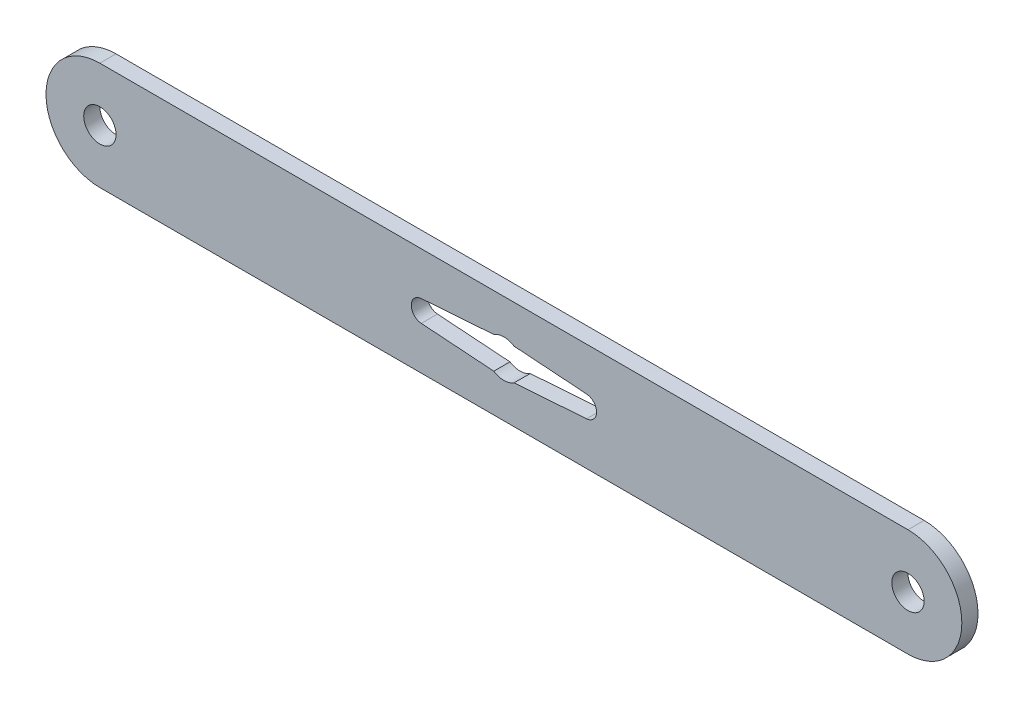
ISO-10303-21;
HEADER;
FILE_DESCRIPTION(('STEP AP214'),'2;1');
FILE_NAME('part.step','',(''),(''),'','','');
FILE_SCHEMA(('AUTOMOTIVE_DESIGN { 1 0 10303 214 1 1 1 1 }'));
ENDSEC;
DATA;
#1=APPLICATION_CONTEXT('core data for automotive mechanical design processes');
#2=APPLICATION_PROTOCOL_DEFINITION('international standard','automotive_design',2000,#1);
#3=PRODUCT_CONTEXT('',#1,'mechanical');
#4=PRODUCT('Part','Part','',(#3));
#5=PRODUCT_RELATED_PRODUCT_CATEGORY('part','',(#4));
#6=PRODUCT_DEFINITION_FORMATION('','',#4);
#7=PRODUCT_DEFINITION_CONTEXT('part definition',#1,'design');
#8=PRODUCT_DEFINITION('design','',#6,#7);
#9=PRODUCT_DEFINITION_SHAPE('','',#8);
#10=(LENGTH_UNIT() NAMED_UNIT(*) SI_UNIT(.MILLI.,.METRE.));
#11=(NAMED_UNIT(*) PLANE_ANGLE_UNIT() SI_UNIT($,.RADIAN.));
#12=(NAMED_UNIT(*) SI_UNIT($,.STERADIAN.) SOLID_ANGLE_UNIT());
#13=UNCERTAINTY_MEASURE_WITH_UNIT(LENGTH_MEASURE(1.E-05),#10,'distance_accuracy_value','');
#14=(GEOMETRIC_REPRESENTATION_CONTEXT(3) GLOBAL_UNCERTAINTY_ASSIGNED_CONTEXT((#13)) GLOBAL_UNIT_ASSIGNED_CONTEXT((#10,
#11,#12)) REPRESENTATION_CONTEXT('',''));
#15=CARTESIAN_POINT('',(0.,0.,0.));
#16=DIRECTION('',(0.,0.,1.));
#17=DIRECTION('',(1.,0.,0.));
#18=AXIS2_PLACEMENT_3D('',#15,#16,#17);
#19=CARTESIAN_POINT('',(75.,0.,3.));
#20=DIRECTION('',(0.,0.,1.));
#21=DIRECTION('',(1.,0.,0.));
#22=AXIS2_PLACEMENT_3D('',#19,#20,#21);
#23=PLANE('',#22);
#24=DIRECTION('',(-0.997491646220285,-0.0707842900702252,0.));
#25=VECTOR('',#24,1.);
#26=CARTESIAN_POINT('',(-1.88348082018375,2.94999999999999,3.));
#27=LINE('',#26,#25);
#28=CARTESIAN_POINT('',(-1.88348082018375,2.94999999999999,3.));
#29=VERTEX_POINT('',#28);
#30=CARTESIAN_POINT('',(-15.3415685801405,1.99498329244057,3.));
#31=VERTEX_POINT('',#30);
#32=EDGE_CURVE('E134',#29,#31,#27,.T.);
#33=ORIENTED_EDGE('',*,*,#32,.F.);
#34=CARTESIAN_POINT('',(0.,0.,3.));
#35=DIRECTION('',(0.,0.,1.));
#36=DIRECTION('',(1.,0.,0.));
#37=AXIS2_PLACEMENT_3D('',#34,#35,#36);
#38=CIRCLE('',#37,3.5);
#39=CARTESIAN_POINT('',(1.88348082018375,2.94999999999999,3.));
#40=VERTEX_POINT('',#39);
#41=EDGE_CURVE('E126',#40,#29,#38,.T.);
#42=ORIENTED_EDGE('',*,*,#41,.F.);
#43=DIRECTION('',(-0.997491646220285,0.070784290070225,0.));
#44=VECTOR('',#43,1.);
#45=CARTESIAN_POINT('',(1.88348082018375,2.94999999999999,3.));
#46=LINE('',#45,#44);
#47=CARTESIAN_POINT('',(15.3415685801404,1.99498329244057,3.));
#48=VERTEX_POINT('',#47);
#49=EDGE_CURVE('E161',#48,#40,#46,.T.);
#50=ORIENTED_EDGE('',*,*,#49,.F.);
#51=CARTESIAN_POINT('',(15.2,0.,3.));
#52=DIRECTION('',(0.,0.,1.));
#53=DIRECTION('',(-1.,0.,0.));
#54=AXIS2_PLACEMENT_3D('',#51,#52,#53);
#55=CIRCLE('',#54,2.);
#56=CARTESIAN_POINT('',(15.3415685801405,-1.99498329244057,3.));
#57=VERTEX_POINT('',#56);
#58=EDGE_CURVE('E159',#57,#48,#55,.T.);
#59=ORIENTED_EDGE('',*,*,#58,.F.);
#60=DIRECTION('',(0.997491646220285,0.0707842900702261,0.));
#61=VECTOR('',#60,1.);
#62=CARTESIAN_POINT('',(1.88348082018375,-2.95000000000001,3.));
#63=LINE('',#62,#61);
#64=CARTESIAN_POINT('',(1.88348082018375,-2.95000000000001,3.));
#65=VERTEX_POINT('',#64);
#66=EDGE_CURVE('E157',#65,#57,#63,.T.);
#67=ORIENTED_EDGE('',*,*,#66,.F.);
#68=CARTESIAN_POINT('',(0.,0.,3.));
#69=DIRECTION('',(0.,0.,1.));
#70=DIRECTION('',(1.,0.,0.));
#71=AXIS2_PLACEMENT_3D('',#68,#69,#70);
#72=CIRCLE('',#71,3.50000000000001);
#73=CARTESIAN_POINT('',(-1.88348082018375,-2.95000000000001,3.));
#74=VERTEX_POINT('',#73);
#75=EDGE_CURVE('E155',#74,#65,#72,.T.);
#76=ORIENTED_EDGE('',*,*,#75,.F.);
#77=DIRECTION('',(0.997491646220285,-0.0707842900702266,0.));
#78=VECTOR('',#77,1.);
#79=CARTESIAN_POINT('',(-1.88348082018375,-2.95000000000001,3.));
#80=LINE('',#79,#78);
#81=CARTESIAN_POINT('',(-15.3415685801405,-1.99498329244057,3.));
#82=VERTEX_POINT('',#81);
#83=EDGE_CURVE('E150',#82,#74,#80,.T.);
#84=ORIENTED_EDGE('',*,*,#83,.F.);
#85=CARTESIAN_POINT('',(-15.2,0.,3.));
#86=DIRECTION('',(0.,0.,1.));
#87=DIRECTION('',(1.,0.,0.));
#88=AXIS2_PLACEMENT_3D('',#85,#86,#87);
#89=CIRCLE('',#88,2.);
#90=EDGE_CURVE('E148',#31,#82,#89,.T.);
#91=ORIENTED_EDGE('',*,*,#90,.F.);
#92=EDGE_LOOP('',(#33,#42,#50,#59,#67,#76,#84,#91));
#93=FACE_BOUND('',#92,.T.);
#94=CARTESIAN_POINT('',(75.,0.,3.));
#95=DIRECTION('',(0.,0.,1.));
#96=DIRECTION('',(1.,0.,0.));
#97=AXIS2_PLACEMENT_3D('',#94,#95,#96);
#98=CIRCLE('',#97,3.00000000000001);
#99=CARTESIAN_POINT('',(78.,0.,3.));
#100=VERTEX_POINT('',#99);
#101=EDGE_CURVE('E194',#100,#100,#98,.T.);
#102=ORIENTED_EDGE('',*,*,#101,.F.);
#103=EDGE_LOOP('',(#102));
#104=FACE_BOUND('',#103,.T.);
#105=CARTESIAN_POINT('',(75.,0.,3.));
#106=DIRECTION('',(0.,0.,1.));
#107=DIRECTION('',(1.,0.,0.));
#108=AXIS2_PLACEMENT_3D('',#105,#106,#107);
#109=CIRCLE('',#108,10.);
#110=CARTESIAN_POINT('',(75.,-10.,3.));
#111=VERTEX_POINT('',#110);
#112=CARTESIAN_POINT('',(75.,9.99999999999998,3.));
#113=VERTEX_POINT('',#112);
#114=EDGE_CURVE('E200',#111,#113,#109,.T.);
#115=ORIENTED_EDGE('',*,*,#114,.T.);
#116=DIRECTION('',(-1.,0.,0.));
#117=VECTOR('',#116,1.);
#118=CARTESIAN_POINT('',(75.,9.99999999999998,3.));
#119=LINE('',#118,#117);
#120=CARTESIAN_POINT('',(-75.,10.,3.));
#121=VERTEX_POINT('',#120);
#122=EDGE_CURVE('E203',#113,#121,#119,.T.);
#123=ORIENTED_EDGE('',*,*,#122,.T.);
#124=CARTESIAN_POINT('',(-75.,0.,3.));
#125=DIRECTION('',(0.,0.,1.));
#126=DIRECTION('',(1.,0.,0.));
#127=AXIS2_PLACEMENT_3D('',#124,#125,#126);
#128=CIRCLE('',#127,10.);
#129=CARTESIAN_POINT('',(-75.,-10.,3.));
#130=VERTEX_POINT('',#129);
#131=EDGE_CURVE('E206',#121,#130,#128,.T.);
#132=ORIENTED_EDGE('',*,*,#131,.T.);
#133=DIRECTION('',(1.,0.,0.));
#134=VECTOR('',#133,1.);
#135=CARTESIAN_POINT('',(75.,-10.,3.));
#136=LINE('',#135,#134);
#137=EDGE_CURVE('E208',#130,#111,#136,.T.);
#138=ORIENTED_EDGE('',*,*,#137,.T.);
#139=EDGE_LOOP('',(#115,#123,#132,#138));
#140=FACE_BOUND('',#139,.T.);
#141=CARTESIAN_POINT('',(-75.,0.,3.));
#142=DIRECTION('',(0.,0.,1.));
#143=DIRECTION('',(-1.,0.,0.));
#144=AXIS2_PLACEMENT_3D('',#141,#142,#143);
#145=CIRCLE('',#144,3.00000000000001);
#146=CARTESIAN_POINT('',(-78.,0.,3.));
#147=VERTEX_POINT('',#146);
#148=EDGE_CURVE('E164',#147,#147,#145,.T.);
#149=ORIENTED_EDGE('',*,*,#148,.F.);
#150=EDGE_LOOP('',(#149));
#151=FACE_BOUND('',#150,.T.);
#152=ADVANCED_FACE('F37',(#93,#104,#140,#151),#23,.T.);
#153=CARTESIAN_POINT('',(75.,0.,0.));
#154=DIRECTION('',(0.,0.,1.));
#155=DIRECTION('',(1.,0.,0.));
#156=AXIS2_PLACEMENT_3D('',#153,#154,#155);
#157=PLANE('',#156);
#158=CARTESIAN_POINT('',(75.,0.,0.));
#159=DIRECTION('',(0.,0.,1.));
#160=DIRECTION('',(1.,0.,0.));
#161=AXIS2_PLACEMENT_3D('',#158,#159,#160);
#162=CIRCLE('',#161,3.00000000000001);
#163=CARTESIAN_POINT('',(78.,0.,0.));
#164=VERTEX_POINT('',#163);
#165=EDGE_CURVE('E142',#164,#164,#162,.T.);
#166=ORIENTED_EDGE('',*,*,#165,.T.);
#167=EDGE_LOOP('',(#166));
#168=FACE_BOUND('',#167,.T.);
#169=CARTESIAN_POINT('',(75.,0.,0.));
#170=DIRECTION('',(0.,0.,1.));
#171=DIRECTION('',(1.,0.,0.));
#172=AXIS2_PLACEMENT_3D('',#169,#170,#171);
#173=CIRCLE('',#172,10.);
#174=CARTESIAN_POINT('',(75.,-10.,0.));
#175=VERTEX_POINT('',#174);
#176=CARTESIAN_POINT('',(75.,9.99999999999998,0.));
#177=VERTEX_POINT('',#176);
#178=EDGE_CURVE('E197',#175,#177,#173,.T.);
#179=ORIENTED_EDGE('',*,*,#178,.F.);
#180=DIRECTION('',(1.,0.,0.));
#181=VECTOR('',#180,1.);
#182=CARTESIAN_POINT('',(75.,-10.,0.));
#183=LINE('',#182,#181);
#184=CARTESIAN_POINT('',(-75.,-10.,0.));
#185=VERTEX_POINT('',#184);
#186=EDGE_CURVE('E204',#185,#175,#183,.T.);
#187=ORIENTED_EDGE('',*,*,#186,.F.);
#188=CARTESIAN_POINT('',(-75.,0.,0.));
#189=DIRECTION('',(0.,0.,1.));
#190=DIRECTION('',(1.,0.,0.));
#191=AXIS2_PLACEMENT_3D('',#188,#189,#190);
#192=CIRCLE('',#191,10.);
#193=CARTESIAN_POINT('',(-75.,10.,0.));
#194=VERTEX_POINT('',#193);
#195=EDGE_CURVE('E215',#194,#185,#192,.T.);
#196=ORIENTED_EDGE('',*,*,#195,.F.);
#197=DIRECTION('',(-1.,0.,0.));
#198=VECTOR('',#197,1.);
#199=CARTESIAN_POINT('',(75.,9.99999999999998,0.));
#200=LINE('',#199,#198);
#201=EDGE_CURVE('E213',#177,#194,#200,.T.);
#202=ORIENTED_EDGE('',*,*,#201,.F.);
#203=EDGE_LOOP('',(#179,#187,#196,#202));
#204=FACE_BOUND('',#203,.T.);
#205=CARTESIAN_POINT('',(0.,0.,0.));
#206=DIRECTION('',(0.,0.,1.));
#207=DIRECTION('',(1.,0.,0.));
#208=AXIS2_PLACEMENT_3D('',#205,#206,#207);
#209=CIRCLE('',#208,3.5);
#210=CARTESIAN_POINT('',(1.88348082018375,2.94999999999999,0.));
#211=VERTEX_POINT('',#210);
#212=CARTESIAN_POINT('',(-1.88348082018375,2.94999999999999,0.));
#213=VERTEX_POINT('',#212);
#214=EDGE_CURVE('E60',#211,#213,#209,.T.);
#215=ORIENTED_EDGE('',*,*,#214,.T.);
#216=DIRECTION('',(-0.997491646220285,-0.0707842900702252,0.));
#217=VECTOR('',#216,1.);
#218=CARTESIAN_POINT('',(-1.88348082018375,2.94999999999999,0.));
#219=LINE('',#218,#217);
#220=CARTESIAN_POINT('',(-15.3415685801405,1.99498329244057,0.));
#221=VERTEX_POINT('',#220);
#222=EDGE_CURVE('E141',#213,#221,#219,.T.);
#223=ORIENTED_EDGE('',*,*,#222,.T.);
#224=CARTESIAN_POINT('',(-15.2,0.,0.));
#225=DIRECTION('',(0.,0.,1.));
#226=DIRECTION('',(1.,0.,0.));
#227=AXIS2_PLACEMENT_3D('',#224,#225,#226);
#228=CIRCLE('',#227,2.);
#229=CARTESIAN_POINT('',(-15.3415685801405,-1.99498329244057,0.));
#230=VERTEX_POINT('',#229);
#231=EDGE_CURVE('E166',#221,#230,#228,.T.);
#232=ORIENTED_EDGE('',*,*,#231,.T.);
#233=DIRECTION('',(0.997491646220285,-0.0707842900702266,0.));
#234=VECTOR('',#233,1.);
#235=CARTESIAN_POINT('',(-1.88348082018375,-2.95000000000001,0.));
#236=LINE('',#235,#234);
#237=CARTESIAN_POINT('',(-1.88348082018375,-2.95000000000001,0.));
#238=VERTEX_POINT('',#237);
#239=EDGE_CURVE('E169',#230,#238,#236,.T.);
#240=ORIENTED_EDGE('',*,*,#239,.T.);
#241=CARTESIAN_POINT('',(0.,0.,0.));
#242=DIRECTION('',(0.,0.,1.));
#243=DIRECTION('',(1.,0.,0.));
#244=AXIS2_PLACEMENT_3D('',#241,#242,#243);
#245=CIRCLE('',#244,3.50000000000001);
#246=CARTESIAN_POINT('',(1.88348082018375,-2.95000000000001,0.));
#247=VERTEX_POINT('',#246);
#248=EDGE_CURVE('E172',#238,#247,#245,.T.);
#249=ORIENTED_EDGE('',*,*,#248,.T.);
#250=DIRECTION('',(0.997491646220285,0.0707842900702261,0.));
#251=VECTOR('',#250,1.);
#252=CARTESIAN_POINT('',(1.88348082018375,-2.95000000000001,0.));
#253=LINE('',#252,#251);
#254=CARTESIAN_POINT('',(15.3415685801405,-1.99498329244057,0.));
#255=VERTEX_POINT('',#254);
#256=EDGE_CURVE('E175',#247,#255,#253,.T.);
#257=ORIENTED_EDGE('',*,*,#256,.T.);
#258=CARTESIAN_POINT('',(15.2,0.,0.));
#259=DIRECTION('',(0.,0.,1.));
#260=DIRECTION('',(-1.,0.,0.));
#261=AXIS2_PLACEMENT_3D('',#258,#259,#260);
#262=CIRCLE('',#261,2.);
#263=CARTESIAN_POINT('',(15.3415685801405,1.99498329244058,0.));
#264=VERTEX_POINT('',#263);
#265=EDGE_CURVE('E178',#255,#264,#262,.T.);
#266=ORIENTED_EDGE('',*,*,#265,.T.);
#267=DIRECTION('',(-0.997491646220285,0.070784290070225,0.));
#268=VECTOR('',#267,1.);
#269=CARTESIAN_POINT('',(1.88348082018375,2.94999999999999,0.));
#270=LINE('',#269,#268);
#271=EDGE_CURVE('E135',#264,#211,#270,.T.);
#272=ORIENTED_EDGE('',*,*,#271,.T.);
#273=EDGE_LOOP('',(#215,#223,#232,#240,#249,#257,#266,#272));
#274=FACE_BOUND('',#273,.T.);
#275=CARTESIAN_POINT('',(-75.,0.,0.));
#276=DIRECTION('',(0.,0.,1.));
#277=DIRECTION('',(-1.,0.,0.));
#278=AXIS2_PLACEMENT_3D('',#275,#276,#277);
#279=CIRCLE('',#278,3.00000000000001);
#280=CARTESIAN_POINT('',(-78.,0.,0.));
#281=VERTEX_POINT('',#280);
#282=EDGE_CURVE('E311',#281,#281,#279,.T.);
#283=ORIENTED_EDGE('',*,*,#282,.T.);
#284=EDGE_LOOP('',(#283));
#285=FACE_BOUND('',#284,.T.);
#286=ADVANCED_FACE('F233',(#168,#204,#274,#285),#157,.F.);
#287=CARTESIAN_POINT('',(75.,0.,3.));
#288=DIRECTION('',(0.,0.,-1.));
#289=DIRECTION('',(-1.,0.,0.));
#290=AXIS2_PLACEMENT_3D('',#287,#288,#289);
#291=CYLINDRICAL_SURFACE('',#290,10.);
#292=ORIENTED_EDGE('',*,*,#178,.T.);
#293=DIRECTION('',(0.,0.,-1.));
#294=VECTOR('',#293,1.);
#295=CARTESIAN_POINT('',(75.,9.99999999999998,3.));
#296=LINE('',#295,#294);
#297=EDGE_CURVE('E11',#113,#177,#296,.T.);
#298=ORIENTED_EDGE('',*,*,#297,.F.);
#299=ORIENTED_EDGE('',*,*,#114,.F.);
#300=DIRECTION('',(0.,0.,-1.));
#301=VECTOR('',#300,1.);
#302=CARTESIAN_POINT('',(75.,-10.,3.));
#303=LINE('',#302,#301);
#304=EDGE_CURVE('E210',#111,#175,#303,.T.);
#305=ORIENTED_EDGE('',*,*,#304,.T.);
#306=EDGE_LOOP('',(#292,#298,#299,#305));
#307=FACE_BOUND('',#306,.T.);
#308=ADVANCED_FACE('F39',(#307),#291,.T.);
#309=CARTESIAN_POINT('',(75.,9.99999999999998,3.));
#310=DIRECTION('',(0.,-1.,0.));
#311=DIRECTION('',(1.,0.,0.));
#312=AXIS2_PLACEMENT_3D('',#309,#310,#311);
#313=PLANE('',#312);
#314=ORIENTED_EDGE('',*,*,#201,.T.);
#315=DIRECTION('',(0.,0.,-1.));
#316=VECTOR('',#315,1.);
#317=CARTESIAN_POINT('',(-75.,10.,3.));
#318=LINE('',#317,#316);
#319=EDGE_CURVE('E45',#121,#194,#318,.T.);
#320=ORIENTED_EDGE('',*,*,#319,.F.);
#321=ORIENTED_EDGE('',*,*,#122,.F.);
#322=ORIENTED_EDGE('',*,*,#297,.T.);
#323=EDGE_LOOP('',(#314,#320,#321,#322));
#324=FACE_BOUND('',#323,.T.);
#325=ADVANCED_FACE('F244',(#324),#313,.F.);
#326=CARTESIAN_POINT('',(-75.,0.,3.));
#327=DIRECTION('',(0.,0.,-1.));
#328=DIRECTION('',(-1.,0.,0.));
#329=AXIS2_PLACEMENT_3D('',#326,#327,#328);
#330=CYLINDRICAL_SURFACE('',#329,10.);
#331=ORIENTED_EDGE('',*,*,#195,.T.);
#332=DIRECTION('',(0.,0.,-1.));
#333=VECTOR('',#332,1.);
#334=CARTESIAN_POINT('',(-75.,-10.,3.));
#335=LINE('',#334,#333);
#336=EDGE_CURVE('E220',#130,#185,#335,.T.);
#337=ORIENTED_EDGE('',*,*,#336,.F.);
#338=ORIENTED_EDGE('',*,*,#131,.F.);
#339=ORIENTED_EDGE('',*,*,#319,.T.);
#340=EDGE_LOOP('',(#331,#337,#338,#339));
#341=FACE_BOUND('',#340,.T.);
#342=ADVANCED_FACE('F227',(#341),#330,.T.);
#343=CARTESIAN_POINT('',(75.,-10.,3.));
#344=DIRECTION('',(0.,1.,0.));
#345=DIRECTION('',(-1.,0.,0.));
#346=AXIS2_PLACEMENT_3D('',#343,#344,#345);
#347=PLANE('',#346);
#348=ORIENTED_EDGE('',*,*,#186,.T.);
#349=ORIENTED_EDGE('',*,*,#304,.F.);
#350=ORIENTED_EDGE('',*,*,#137,.F.);
#351=ORIENTED_EDGE('',*,*,#336,.T.);
#352=EDGE_LOOP('',(#348,#349,#350,#351));
#353=FACE_BOUND('',#352,.T.);
#354=ADVANCED_FACE('F237',(#353),#347,.F.);
#355=CARTESIAN_POINT('',(75.,0.,3.));
#356=DIRECTION('',(0.,0.,-1.));
#357=DIRECTION('',(-1.,0.,0.));
#358=AXIS2_PLACEMENT_3D('',#355,#356,#357);
#359=CYLINDRICAL_SURFACE('',#358,3.00000000000001);
#360=ORIENTED_EDGE('',*,*,#101,.T.);
#361=EDGE_LOOP('',(#360));
#362=FACE_BOUND('',#361,.T.);
#363=ORIENTED_EDGE('',*,*,#165,.F.);
#364=EDGE_LOOP('',(#363));
#365=FACE_BOUND('',#364,.T.);
#366=ADVANCED_FACE('F259',(#362,#365),#359,.F.);
#367=CARTESIAN_POINT('',(0.,0.,3.));
#368=DIRECTION('',(0.,0.,-1.));
#369=DIRECTION('',(-1.,0.,0.));
#370=AXIS2_PLACEMENT_3D('',#367,#368,#369);
#371=CYLINDRICAL_SURFACE('',#370,3.5);
#372=ORIENTED_EDGE('',*,*,#214,.F.);
#373=DIRECTION('',(0.,0.,-1.));
#374=VECTOR('',#373,1.);
#375=CARTESIAN_POINT('',(1.88348082018375,2.94999999999999,3.));
#376=LINE('',#375,#374);
#377=EDGE_CURVE('E130',#40,#211,#376,.T.);
#378=ORIENTED_EDGE('',*,*,#377,.F.);
#379=ORIENTED_EDGE('',*,*,#41,.T.);
#380=DIRECTION('',(0.,0.,-1.));
#381=VECTOR('',#380,1.);
#382=CARTESIAN_POINT('',(-1.88348082018375,2.94999999999999,3.));
#383=LINE('',#382,#381);
#384=EDGE_CURVE('E129',#29,#213,#383,.T.);
#385=ORIENTED_EDGE('',*,*,#384,.T.);
#386=EDGE_LOOP('',(#372,#378,#379,#385));
#387=FACE_BOUND('',#386,.T.);
#388=ADVANCED_FACE('F128',(#387),#371,.F.);
#389=CARTESIAN_POINT('',(-1.88348082018375,2.94999999999999,3.));
#390=DIRECTION('',(0.0707842900702252,-0.997491646220285,0.));
#391=DIRECTION('',(0.997491646220285,0.0707842900702253,0.));
#392=AXIS2_PLACEMENT_3D('',#389,#390,#391);
#393=PLANE('',#392);
#394=ORIENTED_EDGE('',*,*,#222,.F.);
#395=ORIENTED_EDGE('',*,*,#384,.F.);
#396=ORIENTED_EDGE('',*,*,#32,.T.);
#397=DIRECTION('',(0.,0.,-1.));
#398=VECTOR('',#397,1.);
#399=CARTESIAN_POINT('',(-15.3415685801405,1.99498329244057,3.));
#400=LINE('',#399,#398);
#401=EDGE_CURVE('E143',#31,#221,#400,.T.);
#402=ORIENTED_EDGE('',*,*,#401,.T.);
#403=EDGE_LOOP('',(#394,#395,#396,#402));
#404=FACE_BOUND('',#403,.T.);
#405=ADVANCED_FACE('F138',(#404),#393,.T.);
#406=CARTESIAN_POINT('',(-15.2,0.,3.));
#407=DIRECTION('',(0.,0.,-1.));
#408=DIRECTION('',(-1.,0.,0.));
#409=AXIS2_PLACEMENT_3D('',#406,#407,#408);
#410=CYLINDRICAL_SURFACE('',#409,2.);
#411=ORIENTED_EDGE('',*,*,#231,.F.);
#412=ORIENTED_EDGE('',*,*,#401,.F.);
#413=ORIENTED_EDGE('',*,*,#90,.T.);
#414=DIRECTION('',(0.,0.,-1.));
#415=VECTOR('',#414,1.);
#416=CARTESIAN_POINT('',(-15.3415685801405,-1.99498329244057,3.));
#417=LINE('',#416,#415);
#418=EDGE_CURVE('E191',#82,#230,#417,.T.);
#419=ORIENTED_EDGE('',*,*,#418,.T.);
#420=EDGE_LOOP('',(#411,#412,#413,#419));
#421=FACE_BOUND('',#420,.T.);
#422=ADVANCED_FACE('F276',(#421),#410,.F.);
#423=CARTESIAN_POINT('',(-1.88348082018375,-2.95000000000001,3.));
#424=DIRECTION('',(0.0707842900702266,0.997491646220285,0.));
#425=DIRECTION('',(-0.997491646220285,0.0707842900702267,0.));
#426=AXIS2_PLACEMENT_3D('',#423,#424,#425);
#427=PLANE('',#426);
#428=ORIENTED_EDGE('',*,*,#239,.F.);
#429=ORIENTED_EDGE('',*,*,#418,.F.);
#430=ORIENTED_EDGE('',*,*,#83,.T.);
#431=DIRECTION('',(0.,0.,-1.));
#432=VECTOR('',#431,1.);
#433=CARTESIAN_POINT('',(-1.88348082018375,-2.95000000000001,3.));
#434=LINE('',#433,#432);
#435=EDGE_CURVE('E189',#74,#238,#434,.T.);
#436=ORIENTED_EDGE('',*,*,#435,.T.);
#437=EDGE_LOOP('',(#428,#429,#430,#436));
#438=FACE_BOUND('',#437,.T.);
#439=ADVANCED_FACE('F281',(#438),#427,.T.);
#440=CARTESIAN_POINT('',(0.,0.,3.));
#441=DIRECTION('',(0.,0.,-1.));
#442=DIRECTION('',(-1.,0.,0.));
#443=AXIS2_PLACEMENT_3D('',#440,#441,#442);
#444=CYLINDRICAL_SURFACE('',#443,3.50000000000001);
#445=ORIENTED_EDGE('',*,*,#248,.F.);
#446=ORIENTED_EDGE('',*,*,#435,.F.);
#447=ORIENTED_EDGE('',*,*,#75,.T.);
#448=DIRECTION('',(0.,0.,-1.));
#449=VECTOR('',#448,1.);
#450=CARTESIAN_POINT('',(1.88348082018375,-2.95000000000001,3.));
#451=LINE('',#450,#449);
#452=EDGE_CURVE('E187',#65,#247,#451,.T.);
#453=ORIENTED_EDGE('',*,*,#452,.T.);
#454=EDGE_LOOP('',(#445,#446,#447,#453));
#455=FACE_BOUND('',#454,.T.);
#456=ADVANCED_FACE('F285',(#455),#444,.F.);
#457=CARTESIAN_POINT('',(1.88348082018375,-2.95000000000001,3.));
#458=DIRECTION('',(-0.0707842900702261,0.997491646220285,0.));
#459=DIRECTION('',(-0.997491646220285,-0.0707842900702261,0.));
#460=AXIS2_PLACEMENT_3D('',#457,#458,#459);
#461=PLANE('',#460);
#462=ORIENTED_EDGE('',*,*,#256,.F.);
#463=ORIENTED_EDGE('',*,*,#452,.F.);
#464=ORIENTED_EDGE('',*,*,#66,.T.);
#465=DIRECTION('',(0.,0.,-1.));
#466=VECTOR('',#465,1.);
#467=CARTESIAN_POINT('',(15.3415685801405,-1.99498329244057,3.));
#468=LINE('',#467,#466);
#469=EDGE_CURVE('E185',#57,#255,#468,.T.);
#470=ORIENTED_EDGE('',*,*,#469,.T.);
#471=EDGE_LOOP('',(#462,#463,#464,#470));
#472=FACE_BOUND('',#471,.T.);
#473=ADVANCED_FACE('F289',(#472),#461,.T.);
#474=CARTESIAN_POINT('',(15.2,0.,3.));
#475=DIRECTION('',(0.,0.,-1.));
#476=DIRECTION('',(-1.,0.,0.));
#477=AXIS2_PLACEMENT_3D('',#474,#475,#476);
#478=CYLINDRICAL_SURFACE('',#477,2.);
#479=ORIENTED_EDGE('',*,*,#265,.F.);
#480=ORIENTED_EDGE('',*,*,#469,.F.);
#481=ORIENTED_EDGE('',*,*,#58,.T.);
#482=DIRECTION('',(0.,0.,-1.));
#483=VECTOR('',#482,1.);
#484=CARTESIAN_POINT('',(15.3415685801405,1.99498329244058,3.));
#485=LINE('',#484,#483);
#486=EDGE_CURVE('E52',#48,#264,#485,.T.);
#487=ORIENTED_EDGE('',*,*,#486,.T.);
#488=EDGE_LOOP('',(#479,#480,#481,#487));
#489=FACE_BOUND('',#488,.T.);
#490=ADVANCED_FACE('F293',(#489),#478,.F.);
#491=CARTESIAN_POINT('',(1.88348082018375,2.94999999999999,3.));
#492=DIRECTION('',(-0.070784290070225,-0.997491646220285,0.));
#493=DIRECTION('',(0.997491646220285,-0.070784290070225,0.));
#494=AXIS2_PLACEMENT_3D('',#491,#492,#493);
#495=PLANE('',#494);
#496=ORIENTED_EDGE('',*,*,#271,.F.);
#497=ORIENTED_EDGE('',*,*,#486,.F.);
#498=ORIENTED_EDGE('',*,*,#49,.T.);
#499=ORIENTED_EDGE('',*,*,#377,.T.);
#500=EDGE_LOOP('',(#496,#497,#498,#499));
#501=FACE_BOUND('',#500,.T.);
#502=ADVANCED_FACE('F297',(#501),#495,.T.);
#503=CARTESIAN_POINT('',(-75.,0.,3.));
#504=DIRECTION('',(0.,0.,-1.));
#505=DIRECTION('',(-1.,0.,0.));
#506=AXIS2_PLACEMENT_3D('',#503,#504,#505);
#507=CYLINDRICAL_SURFACE('',#506,3.00000000000001);
#508=ORIENTED_EDGE('',*,*,#148,.T.);
#509=EDGE_LOOP('',(#508));
#510=FACE_BOUND('',#509,.T.);
#511=ORIENTED_EDGE('',*,*,#282,.F.);
#512=EDGE_LOOP('',(#511));
#513=FACE_BOUND('',#512,.T.);
#514=ADVANCED_FACE('F301',(#510,#513),#507,.F.);
#515=CLOSED_SHELL('',(#152,#286,#308,#325,#342,#354,#366,#388,#405,#422,#439,#456,#473,#490,
#502,#514));
#516=MANIFOLD_SOLID_BREP('B2',#515);
#517=ADVANCED_BREP_SHAPE_REPRESENTATION('',(#18,#516),#14);
#518=SHAPE_DEFINITION_REPRESENTATION(#9,#517);
ENDSEC;
END-ISO-10303-21;
